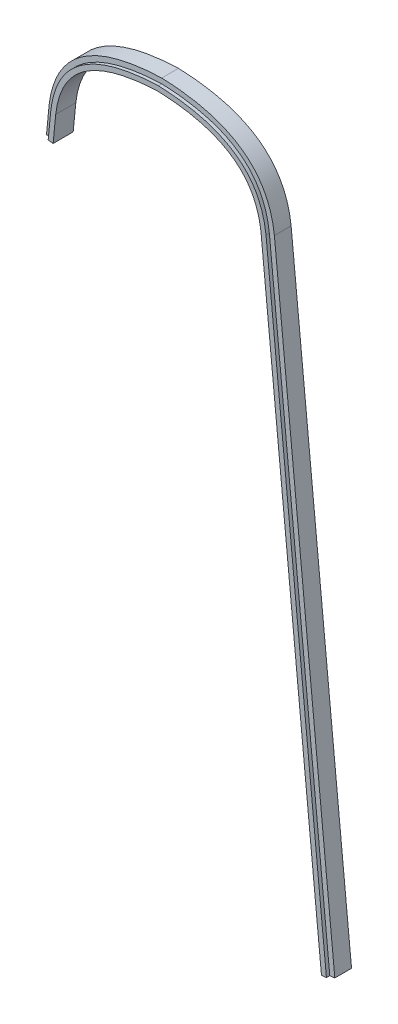
ISO-10303-21;
HEADER;
FILE_DESCRIPTION(('STEP AP214'),'2;1');
FILE_NAME('part.step','',(''),(''),'','','');
FILE_SCHEMA(('AUTOMOTIVE_DESIGN { 1 0 10303 214 1 1 1 1 }'));
ENDSEC;
DATA;
#1=APPLICATION_CONTEXT('core data for automotive mechanical design processes');
#2=APPLICATION_PROTOCOL_DEFINITION('international standard','automotive_design',2000,#1);
#3=PRODUCT_CONTEXT('',#1,'mechanical');
#4=PRODUCT('Part','Part','',(#3));
#5=PRODUCT_RELATED_PRODUCT_CATEGORY('part','',(#4));
#6=PRODUCT_DEFINITION_FORMATION('','',#4);
#7=PRODUCT_DEFINITION_CONTEXT('part definition',#1,'design');
#8=PRODUCT_DEFINITION('design','',#6,#7);
#9=PRODUCT_DEFINITION_SHAPE('','',#8);
#10=(LENGTH_UNIT() NAMED_UNIT(*) SI_UNIT(.MILLI.,.METRE.));
#11=(NAMED_UNIT(*) PLANE_ANGLE_UNIT() SI_UNIT($,.RADIAN.));
#12=(NAMED_UNIT(*) SI_UNIT($,.STERADIAN.) SOLID_ANGLE_UNIT());
#13=UNCERTAINTY_MEASURE_WITH_UNIT(LENGTH_MEASURE(1.E-05),#10,'distance_accuracy_value','');
#14=(GEOMETRIC_REPRESENTATION_CONTEXT(3) GLOBAL_UNCERTAINTY_ASSIGNED_CONTEXT((#13)) GLOBAL_UNIT_ASSIGNED_CONTEXT((#10,
#11,#12)) REPRESENTATION_CONTEXT('',''));
#15=CARTESIAN_POINT('',(0.,0.,0.));
#16=DIRECTION('',(0.,0.,1.));
#17=DIRECTION('',(1.,0.,0.));
#18=AXIS2_PLACEMENT_3D('',#15,#16,#17);
#19=CARTESIAN_POINT('',(106.876080835467,736.833680097404,19.05));
#20=CARTESIAN_POINT('',(98.6555645680486,809.385111394009,19.05));
#21=CARTESIAN_POINT('',(0.,812.8,19.05));
#22=B_SPLINE_CURVE_WITH_KNOTS('',2,(#19,#20,#21),.UNSPECIFIED.,.F.,.F.,(3,3),(0.,1.),.UNSPECIFIED.);
#23=DIRECTION('',(0.,0.,-1.));
#24=VECTOR('',#23,1.);
#25=SURFACE_OF_LINEAR_EXTRUSION('',#22,#24);
#26=DIRECTION('',(0.,0.,-1.));
#27=VECTOR('',#26,1.);
#28=CARTESIAN_POINT('',(0.,812.8,19.05));
#29=LINE('',#28,#27);
#30=CARTESIAN_POINT('',(0.,812.8,15.875));
#31=VERTEX_POINT('',#30);
#32=CARTESIAN_POINT('',(0.,812.8,0.));
#33=VERTEX_POINT('',#32);
#34=EDGE_CURVE('E11',#31,#33,#29,.T.);
#35=ORIENTED_EDGE('',*,*,#34,.F.);
#36=CARTESIAN_POINT('',(106.876080835467,736.833680097404,15.875));
#37=CARTESIAN_POINT('',(98.6555645680486,809.385111394009,15.875));
#38=CARTESIAN_POINT('',(0.,812.8,15.875));
#39=B_SPLINE_CURVE_WITH_KNOTS('',2,(#36,#37,#38),.UNSPECIFIED.,.F.,.F.,(3,3),(0.,1.),.UNSPECIFIED.);
#40=CARTESIAN_POINT('',(106.876080835467,736.833680097404,15.875));
#41=VERTEX_POINT('',#40);
#42=EDGE_CURVE('E385',#41,#31,#39,.T.);
#43=ORIENTED_EDGE('',*,*,#42,.F.);
#44=DIRECTION('',(0.,0.,-1.));
#45=VECTOR('',#44,1.);
#46=CARTESIAN_POINT('',(106.876080835467,736.833680097404,19.05));
#47=LINE('',#46,#45);
#48=CARTESIAN_POINT('',(106.876080835467,736.833680097404,0.));
#49=VERTEX_POINT('',#48);
#50=EDGE_CURVE('E96',#41,#49,#47,.T.);
#51=ORIENTED_EDGE('',*,*,#50,.T.);
#52=CARTESIAN_POINT('',(106.876080835467,736.833680097404,0.));
#53=CARTESIAN_POINT('',(98.6555645680486,809.385111394009,0.));
#54=CARTESIAN_POINT('',(0.,812.8,0.));
#55=B_SPLINE_CURVE_WITH_KNOTS('',2,(#52,#53,#54),.UNSPECIFIED.,.F.,.F.,(3,3),(0.,1.),.UNSPECIFIED.);
#56=EDGE_CURVE('E224',#49,#33,#55,.T.);
#57=ORIENTED_EDGE('',*,*,#56,.T.);
#58=EDGE_LOOP('',(#35,#43,#51,#57));
#59=FACE_BOUND('',#58,.T.);
#60=ADVANCED_FACE('F33',(#59),#25,.F.);
#61=CARTESIAN_POINT('',(0.,812.8,19.05));
#62=CARTESIAN_POINT('',(-98.6555645680486,809.385111394009,19.05));
#63=CARTESIAN_POINT('',(-106.876080835467,736.833680097404,19.05));
#64=B_SPLINE_CURVE_WITH_KNOTS('',2,(#61,#62,#63),.UNSPECIFIED.,.F.,.F.,(3,3),(0.,1.),.UNSPECIFIED.);
#65=DIRECTION('',(0.,0.,-1.));
#66=VECTOR('',#65,1.);
#67=SURFACE_OF_LINEAR_EXTRUSION('',#64,#66);
#68=DIRECTION('',(0.,0.,-1.));
#69=VECTOR('',#68,1.);
#70=CARTESIAN_POINT('',(-106.876080835467,736.833680097404,19.05));
#71=LINE('',#70,#69);
#72=CARTESIAN_POINT('',(-106.876080835467,736.833680097404,15.875));
#73=VERTEX_POINT('',#72);
#74=CARTESIAN_POINT('',(-106.876080835467,736.833680097404,0.));
#75=VERTEX_POINT('',#74);
#76=EDGE_CURVE('E41',#73,#75,#71,.T.);
#77=ORIENTED_EDGE('',*,*,#76,.F.);
#78=CARTESIAN_POINT('',(0.,812.8,15.875));
#79=CARTESIAN_POINT('',(-98.6555645680486,809.385111394009,15.875));
#80=CARTESIAN_POINT('',(-106.876080835467,736.833680097404,15.875));
#81=B_SPLINE_CURVE_WITH_KNOTS('',2,(#78,#79,#80),.UNSPECIFIED.,.F.,.F.,(3,3),(0.,1.),.UNSPECIFIED.);
#82=EDGE_CURVE('E386',#31,#73,#81,.T.);
#83=ORIENTED_EDGE('',*,*,#82,.F.);
#84=ORIENTED_EDGE('',*,*,#34,.T.);
#85=CARTESIAN_POINT('',(0.,812.8,0.));
#86=CARTESIAN_POINT('',(-98.6555645680486,809.385111394009,0.));
#87=CARTESIAN_POINT('',(-106.876080835467,736.833680097404,0.));
#88=B_SPLINE_CURVE_WITH_KNOTS('',2,(#85,#86,#87),.UNSPECIFIED.,.F.,.F.,(3,3),(0.,1.),.UNSPECIFIED.);
#89=EDGE_CURVE('E221',#33,#75,#88,.T.);
#90=ORIENTED_EDGE('',*,*,#89,.T.);
#91=EDGE_LOOP('',(#77,#83,#84,#90));
#92=FACE_BOUND('',#91,.T.);
#93=ADVANCED_FACE('F169',(#92),#67,.F.);
#94=CARTESIAN_POINT('',(-109.368223300656,711.556235093346,19.05));
#95=DIRECTION('',(0.995175000159784,-0.0981158450861764,0.));
#96=DIRECTION('',(0.0981158450861764,0.995175000159784,0.));
#97=AXIS2_PLACEMENT_3D('',#94,#95,#96);
#98=PLANE('',#97);
#99=DIRECTION('',(0.,0.,-1.));
#100=VECTOR('',#99,1.);
#101=CARTESIAN_POINT('',(-109.368223300656,711.556235093346,19.05));
#102=LINE('',#101,#100);
#103=CARTESIAN_POINT('',(-109.368223300656,711.556235093346,15.875));
#104=VERTEX_POINT('',#103);
#105=CARTESIAN_POINT('',(-109.368223300656,711.556235093346,0.));
#106=VERTEX_POINT('',#105);
#107=EDGE_CURVE('E207',#104,#106,#102,.T.);
#108=ORIENTED_EDGE('',*,*,#107,.F.);
#109=DIRECTION('',(-0.0981158450861764,-0.995175000159784,0.));
#110=VECTOR('',#109,1.);
#111=CARTESIAN_POINT('',(-109.368223300656,711.556235093346,15.875));
#112=LINE('',#111,#110);
#113=EDGE_CURVE('E218',#73,#104,#112,.T.);
#114=ORIENTED_EDGE('',*,*,#113,.F.);
#115=ORIENTED_EDGE('',*,*,#76,.T.);
#116=DIRECTION('',(-0.0981158450861764,-0.995175000159784,0.));
#117=VECTOR('',#116,1.);
#118=CARTESIAN_POINT('',(-109.368223300656,711.556235093346,0.));
#119=LINE('',#118,#117);
#120=EDGE_CURVE('E214',#75,#106,#119,.T.);
#121=ORIENTED_EDGE('',*,*,#120,.T.);
#122=EDGE_LOOP('',(#108,#114,#115,#121));
#123=FACE_BOUND('',#122,.T.);
#124=ADVANCED_FACE('F166',(#123),#98,.F.);
#125=CARTESIAN_POINT('',(-109.368223300656,711.556235093346,19.05));
#126=DIRECTION('',(0.0981158450861748,0.995175000159784,0.));
#127=DIRECTION('',(-0.995175000159784,0.0981158450861748,0.));
#128=AXIS2_PLACEMENT_3D('',#125,#126,#127);
#129=PLANE('',#128);
#130=DIRECTION('',(0.995175000159784,-0.0981158450861748,0.));
#131=VECTOR('',#130,1.);
#132=CARTESIAN_POINT('',(-109.368223300656,711.556235093346,19.05));
#133=LINE('',#132,#131);
#134=CARTESIAN_POINT('',(-104.590786194889,711.085220167425,19.05));
#135=VERTEX_POINT('',#134);
#136=CARTESIAN_POINT('',(-99.8891814241341,710.6216816689,19.05));
#137=VERTEX_POINT('',#136);
#138=EDGE_CURVE('E104',#135,#137,#133,.T.);
#139=ORIENTED_EDGE('',*,*,#138,.F.);
#140=DIRECTION('',(0.,0.,-1.));
#141=VECTOR('',#140,1.);
#142=CARTESIAN_POINT('',(-104.590786194889,711.085220167425,934.258236266733));
#143=LINE('',#142,#141);
#144=CARTESIAN_POINT('',(-104.590786194889,711.085220167425,15.875));
#145=VERTEX_POINT('',#144);
#146=EDGE_CURVE('E260',#135,#145,#143,.T.);
#147=ORIENTED_EDGE('',*,*,#146,.T.);
#148=DIRECTION('',(0.995175000159784,-0.0981158450861748,0.));
#149=VECTOR('',#148,1.);
#150=CARTESIAN_POINT('',(-109.368223300656,711.556235093346,15.875));
#151=LINE('',#150,#149);
#152=EDGE_CURVE('E388',#104,#145,#151,.T.);
#153=ORIENTED_EDGE('',*,*,#152,.F.);
#154=ORIENTED_EDGE('',*,*,#107,.T.);
#155=DIRECTION('',(0.995175000159784,-0.0981158450861748,0.));
#156=VECTOR('',#155,1.);
#157=CARTESIAN_POINT('',(-109.368223300656,711.556235093346,0.));
#158=LINE('',#157,#156);
#159=CARTESIAN_POINT('',(-99.8891814241341,710.6216816689,0.));
#160=VERTEX_POINT('',#159);
#161=EDGE_CURVE('E228',#106,#160,#158,.T.);
#162=ORIENTED_EDGE('',*,*,#161,.T.);
#163=DIRECTION('',(0.,0.,-1.));
#164=VECTOR('',#163,1.);
#165=CARTESIAN_POINT('',(-99.8891814241341,710.6216816689,19.05));
#166=LINE('',#165,#164);
#167=EDGE_CURVE('E204',#137,#160,#166,.T.);
#168=ORIENTED_EDGE('',*,*,#167,.F.);
#169=EDGE_LOOP('',(#139,#147,#153,#154,#162,#168));
#170=FACE_BOUND('',#169,.T.);
#171=ADVANCED_FACE('F162',(#170),#129,.F.);
#172=CARTESIAN_POINT('',(-99.8891814241341,710.6216816689,19.05));
#173=DIRECTION('',(-0.995175000159784,0.0981158450861764,0.));
#174=DIRECTION('',(-0.0981158450861764,-0.995175000159784,0.));
#175=AXIS2_PLACEMENT_3D('',#172,#173,#174);
#176=PLANE('',#175);
#177=DIRECTION('',(0.0981158450861764,0.995175000159784,0.));
#178=VECTOR('',#177,1.);
#179=CARTESIAN_POINT('',(-99.8891814241341,710.6216816689,0.));
#180=LINE('',#179,#178);
#181=CARTESIAN_POINT('',(-97.4039935722559,735.828587023664,0.));
#182=VERTEX_POINT('',#181);
#183=EDGE_CURVE('E230',#160,#182,#180,.T.);
#184=ORIENTED_EDGE('',*,*,#183,.T.);
#185=DIRECTION('',(0.,0.,-1.));
#186=VECTOR('',#185,1.);
#187=CARTESIAN_POINT('',(-97.4039935722559,735.828587023664,19.05));
#188=LINE('',#187,#186);
#189=CARTESIAN_POINT('',(-97.4039935722559,735.828587023664,19.05));
#190=VERTEX_POINT('',#189);
#191=EDGE_CURVE('E132',#190,#182,#188,.T.);
#192=ORIENTED_EDGE('',*,*,#191,.F.);
#193=DIRECTION('',(0.0981158450861764,0.995175000159784,0.));
#194=VECTOR('',#193,1.);
#195=CARTESIAN_POINT('',(-99.8891814241341,710.6216816689,19.05));
#196=LINE('',#195,#194);
#197=EDGE_CURVE('E120',#137,#190,#196,.T.);
#198=ORIENTED_EDGE('',*,*,#197,.F.);
#199=ORIENTED_EDGE('',*,*,#167,.T.);
#200=EDGE_LOOP('',(#184,#192,#198,#199));
#201=FACE_BOUND('',#200,.T.);
#202=ADVANCED_FACE('F159',(#201),#176,.F.);
#203=CARTESIAN_POINT('',(-97.4039935722559,735.828587023664,19.05));
#204=CARTESIAN_POINT('',(-97.3262059512527,736.510966359992,19.05));
#205=CARTESIAN_POINT('',(-97.1553796672026,737.881968464566,19.05));
#206=CARTESIAN_POINT('',(-96.7640206157546,740.553537606217,19.05));
#207=CARTESIAN_POINT('',(-96.1773627381838,743.805316844235,19.05));
#208=CARTESIAN_POINT('',(-95.3214140006328,747.554999290887,19.05));
#209=CARTESIAN_POINT('',(-93.9799340011733,752.359286406523,19.05));
#210=CARTESIAN_POINT('',(-91.9331304846631,758.003164249533,19.05));
#211=CARTESIAN_POINT('',(-88.8952522600479,764.228265264046,19.05));
#212=CARTESIAN_POINT('',(-85.2743135617021,769.943199813082,19.05));
#213=CARTESIAN_POINT('',(-79.6482414168434,776.932392043286,19.05));
#214=CARTESIAN_POINT('',(-71.0507907120011,784.572420077556,19.05));
#215=CARTESIAN_POINT('',(-60.1294569627941,790.832450745801,19.05));
#216=CARTESIAN_POINT('',(-49.8978420395012,794.967332344283,19.05));
#217=CARTESIAN_POINT('',(-41.4669949701447,797.61410959326,19.05));
#218=CARTESIAN_POINT('',(-32.2731280075781,799.79005238411,19.05));
#219=CARTESIAN_POINT('',(-23.975792062962,801.1984248908,19.05));
#220=CARTESIAN_POINT('',(-16.9573043317647,802.075979485788,19.05));
#221=CARTESIAN_POINT('',(-11.5049121120335,802.608232021652,19.05));
#222=CARTESIAN_POINT('',(-6.80036284859527,802.946009067599,19.05));
#223=CARTESIAN_POINT('',(-2.95007512349235,803.15190905775,19.05));
#224=CARTESIAN_POINT('',(-0.979817657945946,803.233925105122,19.05));
#225=CARTESIAN_POINT('',(4.83771009363032E-13,803.269086279872,19.05));
#226=B_SPLINE_CURVE_WITH_KNOTS('',3,(#203,#204,#205,#206,#207,#208,#209,#210,#211,#212,#213,
#214,#215,#216,#217,#218,#219,#220,#221,#222,#223,#224,#225),.UNSPECIFIED.,.F.,.F.,(4,1,1,1,1,1,
1,1,1,1,1,1,1,1,1,1,1,1,1,1,4),(0.00050817300302827,0.0160981610016207,0.0316881490002131,
0.0628681249973979,0.0940481009945827,0.125228076991767,0.187588028986137,0.249947980980507,
0.312307932974876,0.374667884969246,0.499387788957985,0.624107692946725,0.686467644941094,
0.748827596935464,0.811187548929833,0.873547500924203,0.904727476921388,0.935907452918573,
0.967087428915757,0.98267741691435,0.998267404912942),.UNSPECIFIED.);
#227=DIRECTION('',(0.,0.,-1.));
#228=VECTOR('',#227,1.);
#229=SURFACE_OF_LINEAR_EXTRUSION('',#226,#228);
#230=CARTESIAN_POINT('',(-97.4039935722559,735.828587023664,0.));
#231=CARTESIAN_POINT('',(-97.3262059512527,736.510966359992,0.));
#232=CARTESIAN_POINT('',(-97.1553796672026,737.881968464566,0.));
#233=CARTESIAN_POINT('',(-96.7640206157546,740.553537606217,0.));
#234=CARTESIAN_POINT('',(-96.1773627381838,743.805316844235,0.));
#235=CARTESIAN_POINT('',(-95.3214140006328,747.554999290887,0.));
#236=CARTESIAN_POINT('',(-93.9799340011733,752.359286406523,0.));
#237=CARTESIAN_POINT('',(-91.9331304846631,758.003164249533,0.));
#238=CARTESIAN_POINT('',(-88.8952522600479,764.228265264046,0.));
#239=CARTESIAN_POINT('',(-85.2743135617021,769.943199813082,0.));
#240=CARTESIAN_POINT('',(-79.6482414168434,776.932392043286,0.));
#241=CARTESIAN_POINT('',(-71.0507907120011,784.572420077556,0.));
#242=CARTESIAN_POINT('',(-60.1294569627941,790.832450745801,0.));
#243=CARTESIAN_POINT('',(-49.8978420395012,794.967332344283,0.));
#244=CARTESIAN_POINT('',(-41.4669949701447,797.61410959326,0.));
#245=CARTESIAN_POINT('',(-32.2731280075781,799.79005238411,0.));
#246=CARTESIAN_POINT('',(-23.975792062962,801.1984248908,0.));
#247=CARTESIAN_POINT('',(-16.9573043317647,802.075979485788,0.));
#248=CARTESIAN_POINT('',(-11.5049121120335,802.608232021652,0.));
#249=CARTESIAN_POINT('',(-6.80036284859527,802.946009067599,0.));
#250=CARTESIAN_POINT('',(-2.95007512349235,803.15190905775,0.));
#251=CARTESIAN_POINT('',(-0.979817657945946,803.233925105122,0.));
#252=CARTESIAN_POINT('',(4.83771009363032E-13,803.269086279872,0.));
#253=B_SPLINE_CURVE_WITH_KNOTS('',3,(#230,#231,#232,#233,#234,#235,#236,#237,#238,#239,#240,
#241,#242,#243,#244,#245,#246,#247,#248,#249,#250,#251,#252),.UNSPECIFIED.,.F.,.F.,(4,1,1,1,1,1,
1,1,1,1,1,1,1,1,1,1,1,1,1,1,4),(0.00050817300302827,0.0160981610016207,0.0316881490002131,
0.0628681249973979,0.0940481009945827,0.125228076991767,0.187588028986137,0.249947980980507,
0.312307932974876,0.374667884969246,0.499387788957985,0.624107692946725,0.686467644941094,
0.748827596935464,0.811187548929833,0.873547500924203,0.904727476921388,0.935907452918573,
0.967087428915757,0.98267741691435,0.998267404912942),.UNSPECIFIED.);
#254=CARTESIAN_POINT('',(4.83771009363032E-13,803.269086279872,0.));
#255=VERTEX_POINT('',#254);
#256=EDGE_CURVE('E129',#182,#255,#253,.T.);
#257=ORIENTED_EDGE('',*,*,#256,.T.);
#258=DIRECTION('',(0.,0.,-1.));
#259=VECTOR('',#258,1.);
#260=CARTESIAN_POINT('',(4.83771009363032E-13,803.269086279872,19.05));
#261=LINE('',#260,#259);
#262=CARTESIAN_POINT('',(4.83771009363032E-13,803.269086279872,19.05));
#263=VERTEX_POINT('',#262);
#264=EDGE_CURVE('E126',#263,#255,#261,.T.);
#265=ORIENTED_EDGE('',*,*,#264,.F.);
#266=EDGE_CURVE('E112',#190,#263,#226,.T.);
#267=ORIENTED_EDGE('',*,*,#266,.F.);
#268=ORIENTED_EDGE('',*,*,#191,.T.);
#269=EDGE_LOOP('',(#257,#265,#267,#268));
#270=FACE_BOUND('',#269,.T.);
#271=ADVANCED_FACE('F127',(#270),#229,.F.);
#272=CARTESIAN_POINT('',(-4.7309161796405E-13,803.269086279872,19.05));
#273=CARTESIAN_POINT('',(0.979817657946005,803.233925105122,19.05));
#274=CARTESIAN_POINT('',(2.95007512349249,803.15190905775,19.05));
#275=CARTESIAN_POINT('',(6.80036284859567,802.946009067599,19.05));
#276=CARTESIAN_POINT('',(11.5049121120341,802.608232021652,19.05));
#277=CARTESIAN_POINT('',(16.9573043317656,802.075979485788,19.05));
#278=CARTESIAN_POINT('',(23.9757920629632,801.198424890801,19.05));
#279=CARTESIAN_POINT('',(32.2731280075797,799.79005238411,19.05));
#280=CARTESIAN_POINT('',(41.4669949701467,797.61410959326,19.05));
#281=CARTESIAN_POINT('',(49.8978420395034,794.967332344282,19.05));
#282=CARTESIAN_POINT('',(60.1294569627966,790.8324507458,19.05));
#283=CARTESIAN_POINT('',(71.0507907120036,784.572420077554,19.05));
#284=CARTESIAN_POINT('',(79.648241416846,776.932392043284,19.05));
#285=CARTESIAN_POINT('',(85.2743135617045,769.943199813078,19.05));
#286=CARTESIAN_POINT('',(88.8952522600501,764.228265264043,19.05));
#287=CARTESIAN_POINT('',(91.9331304846649,758.003164249528,19.05));
#288=CARTESIAN_POINT('',(93.979934001175,752.359286406518,19.05));
#289=CARTESIAN_POINT('',(95.3214140006343,747.554999290881,19.05));
#290=CARTESIAN_POINT('',(96.1773627381851,743.805316844229,19.05));
#291=CARTESIAN_POINT('',(96.7640206157557,740.553537606211,19.05));
#292=CARTESIAN_POINT('',(97.1553796672036,737.88196846456,19.05));
#293=CARTESIAN_POINT('',(97.3262059512535,736.510966359985,19.05));
#294=CARTESIAN_POINT('',(97.4039935722567,735.828587023657,19.05));
#295=B_SPLINE_CURVE_WITH_KNOTS('',3,(#272,#273,#274,#275,#276,#277,#278,#279,#280,#281,#282,
#283,#284,#285,#286,#287,#288,#289,#290,#291,#292,#293,#294),.UNSPECIFIED.,.F.,.F.,(4,1,1,1,1,1,
1,1,1,1,1,1,1,1,1,1,1,1,1,1,4),(0.000508173002974233,0.0160981610015676,0.0316881490001608,
0.0628681249973473,0.0940481009945338,0.12522807699172,0.187588028986093,0.249947980980466,
0.312307932974839,0.374667884969212,0.499387788957958,0.624107692946704,0.686467644941077,
0.74882759693545,0.811187548929823,0.873547500924196,0.904727476921383,0.935907452918569,
0.967087428915756,0.982677416914349,0.998267404912942),.UNSPECIFIED.);
#296=DIRECTION('',(0.,0.,-1.));
#297=VECTOR('',#296,1.);
#298=SURFACE_OF_LINEAR_EXTRUSION('',#295,#297);
#299=CARTESIAN_POINT('',(-4.7309161796405E-13,803.269086279872,0.));
#300=CARTESIAN_POINT('',(0.979817657946005,803.233925105122,0.));
#301=CARTESIAN_POINT('',(2.95007512349249,803.15190905775,0.));
#302=CARTESIAN_POINT('',(6.80036284859567,802.946009067599,0.));
#303=CARTESIAN_POINT('',(11.5049121120341,802.608232021652,0.));
#304=CARTESIAN_POINT('',(16.9573043317656,802.075979485788,0.));
#305=CARTESIAN_POINT('',(23.9757920629632,801.198424890801,0.));
#306=CARTESIAN_POINT('',(32.2731280075797,799.79005238411,0.));
#307=CARTESIAN_POINT('',(41.4669949701467,797.61410959326,0.));
#308=CARTESIAN_POINT('',(49.8978420395034,794.967332344282,0.));
#309=CARTESIAN_POINT('',(60.1294569627966,790.8324507458,0.));
#310=CARTESIAN_POINT('',(71.0507907120036,784.572420077554,0.));
#311=CARTESIAN_POINT('',(79.648241416846,776.932392043284,0.));
#312=CARTESIAN_POINT('',(85.2743135617045,769.943199813078,0.));
#313=CARTESIAN_POINT('',(88.8952522600501,764.228265264043,0.));
#314=CARTESIAN_POINT('',(91.9331304846649,758.003164249528,0.));
#315=CARTESIAN_POINT('',(93.979934001175,752.359286406518,0.));
#316=CARTESIAN_POINT('',(95.3214140006343,747.554999290881,0.));
#317=CARTESIAN_POINT('',(96.1773627381851,743.805316844229,0.));
#318=CARTESIAN_POINT('',(96.7640206157557,740.553537606211,0.));
#319=CARTESIAN_POINT('',(97.1553796672036,737.88196846456,0.));
#320=CARTESIAN_POINT('',(97.3262059512535,736.510966359985,0.));
#321=CARTESIAN_POINT('',(97.4039935722567,735.828587023657,0.));
#322=B_SPLINE_CURVE_WITH_KNOTS('',3,(#299,#300,#301,#302,#303,#304,#305,#306,#307,#308,#309,
#310,#311,#312,#313,#314,#315,#316,#317,#318,#319,#320,#321),.UNSPECIFIED.,.F.,.F.,(4,1,1,1,1,1,
1,1,1,1,1,1,1,1,1,1,1,1,1,1,4),(0.000508173002974233,0.0160981610015676,0.0316881490001608,
0.0628681249973473,0.0940481009945338,0.12522807699172,0.187588028986093,0.249947980980466,
0.312307932974839,0.374667884969212,0.499387788957958,0.624107692946704,0.686467644941077,
0.74882759693545,0.811187548929823,0.873547500924196,0.904727476921383,0.935907452918569,
0.967087428915756,0.982677416914349,0.998267404912942),.UNSPECIFIED.);
#323=CARTESIAN_POINT('',(97.4039935722567,735.828587023657,0.));
#324=VERTEX_POINT('',#323);
#325=EDGE_CURVE('E240',#255,#324,#322,.T.);
#326=ORIENTED_EDGE('',*,*,#325,.T.);
#327=DIRECTION('',(0.,0.,-1.));
#328=VECTOR('',#327,1.);
#329=CARTESIAN_POINT('',(97.4039935722567,735.828587023657,19.05));
#330=LINE('',#329,#328);
#331=CARTESIAN_POINT('',(97.4039935722567,735.828587023657,19.05));
#332=VERTEX_POINT('',#331);
#333=EDGE_CURVE('E133',#332,#324,#330,.T.);
#334=ORIENTED_EDGE('',*,*,#333,.F.);
#335=EDGE_CURVE('E117',#263,#332,#295,.T.);
#336=ORIENTED_EDGE('',*,*,#335,.F.);
#337=ORIENTED_EDGE('',*,*,#264,.T.);
#338=EDGE_LOOP('',(#326,#334,#336,#337));
#339=FACE_BOUND('',#338,.T.);
#340=ADVANCED_FACE('F135',(#339),#298,.F.);
#341=CARTESIAN_POINT('',(154.716315658705,154.517891579654,19.05));
#342=DIRECTION('',(0.995175000159714,0.0981158450868872,0.));
#343=DIRECTION('',(-0.0981158450868872,0.995175000159714,0.));
#344=AXIS2_PLACEMENT_3D('',#341,#342,#343);
#345=PLANE('',#344);
#346=DIRECTION('',(0.0981158450868872,-0.995175000159714,0.));
#347=VECTOR('',#346,1.);
#348=CARTESIAN_POINT('',(154.716315658705,154.517891579654,0.));
#349=LINE('',#348,#347);
#350=CARTESIAN_POINT('',(154.716315658705,154.517891579654,0.));
#351=VERTEX_POINT('',#350);
#352=EDGE_CURVE('E192',#324,#351,#349,.T.);
#353=ORIENTED_EDGE('',*,*,#352,.T.);
#354=DIRECTION('',(0.,0.,-1.));
#355=VECTOR('',#354,1.);
#356=CARTESIAN_POINT('',(154.716315658705,154.517891579654,19.05));
#357=LINE('',#356,#355);
#358=CARTESIAN_POINT('',(154.716315658705,154.517891579654,19.05));
#359=VERTEX_POINT('',#358);
#360=EDGE_CURVE('E199',#359,#351,#357,.T.);
#361=ORIENTED_EDGE('',*,*,#360,.F.);
#362=DIRECTION('',(0.0981158450868872,-0.995175000159714,0.));
#363=VECTOR('',#362,1.);
#364=CARTESIAN_POINT('',(154.716315658705,154.517891579654,19.05));
#365=LINE('',#364,#363);
#366=EDGE_CURVE('E57',#332,#359,#365,.T.);
#367=ORIENTED_EDGE('',*,*,#366,.F.);
#368=ORIENTED_EDGE('',*,*,#333,.T.);
#369=EDGE_LOOP('',(#353,#361,#367,#368));
#370=FACE_BOUND('',#369,.T.);
#371=ADVANCED_FACE('F155',(#370),#345,.F.);
#372=CARTESIAN_POINT('',(154.716315658705,154.517891579654,19.05));
#373=DIRECTION('',(-0.0981158450868834,0.995175000159714,0.));
#374=DIRECTION('',(-0.995175000159714,-0.0981158450868834,0.));
#375=AXIS2_PLACEMENT_3D('',#372,#373,#374);
#376=PLANE('',#375);
#377=DIRECTION('',(0.995175000159714,0.0981158450868834,0.));
#378=VECTOR('',#377,1.);
#379=CARTESIAN_POINT('',(154.716315658705,154.517891579654,15.875));
#380=LINE('',#379,#378);
#381=CARTESIAN_POINT('',(159.417920429459,154.981430078182,15.875));
#382=VERTEX_POINT('',#381);
#383=CARTESIAN_POINT('',(164.195357535226,155.452445004106,15.875));
#384=VERTEX_POINT('',#383);
#385=EDGE_CURVE('E306',#382,#384,#380,.T.);
#386=ORIENTED_EDGE('',*,*,#385,.F.);
#387=DIRECTION('',(0.,0.,-1.));
#388=VECTOR('',#387,1.);
#389=CARTESIAN_POINT('',(159.417920429459,154.981430078182,934.258236266733));
#390=LINE('',#389,#388);
#391=CARTESIAN_POINT('',(159.417920429459,154.981430078182,19.05));
#392=VERTEX_POINT('',#391);
#393=EDGE_CURVE('E341',#392,#382,#390,.T.);
#394=ORIENTED_EDGE('',*,*,#393,.F.);
#395=DIRECTION('',(0.995175000159714,0.0981158450868834,0.));
#396=VECTOR('',#395,1.);
#397=CARTESIAN_POINT('',(154.716315658705,154.517891579654,19.05));
#398=LINE('',#397,#396);
#399=EDGE_CURVE('E138',#359,#392,#398,.T.);
#400=ORIENTED_EDGE('',*,*,#399,.F.);
#401=ORIENTED_EDGE('',*,*,#360,.T.);
#402=DIRECTION('',(0.995175000159714,0.0981158450868834,0.));
#403=VECTOR('',#402,1.);
#404=CARTESIAN_POINT('',(154.716315658705,154.517891579654,0.));
#405=LINE('',#404,#403);
#406=CARTESIAN_POINT('',(164.195357535226,155.452445004106,0.));
#407=VERTEX_POINT('',#406);
#408=EDGE_CURVE('E186',#351,#407,#405,.T.);
#409=ORIENTED_EDGE('',*,*,#408,.T.);
#410=DIRECTION('',(0.,0.,-1.));
#411=VECTOR('',#410,1.);
#412=CARTESIAN_POINT('',(164.195357535226,155.452445004106,19.05));
#413=LINE('',#412,#411);
#414=EDGE_CURVE('E197',#384,#407,#413,.T.);
#415=ORIENTED_EDGE('',*,*,#414,.F.);
#416=EDGE_LOOP('',(#386,#394,#400,#401,#409,#415));
#417=FACE_BOUND('',#416,.T.);
#418=ADVANCED_FACE('F255',(#417),#376,.F.);
#419=CARTESIAN_POINT('',(164.195357535226,155.452445004106,19.05));
#420=DIRECTION('',(-0.995175000159714,-0.0981158450868872,0.));
#421=DIRECTION('',(0.0981158450868872,-0.995175000159714,0.));
#422=AXIS2_PLACEMENT_3D('',#419,#420,#421);
#423=PLANE('',#422);
#424=ORIENTED_EDGE('',*,*,#50,.F.);
#425=DIRECTION('',(-0.0981158450868872,0.995175000159713,0.));
#426=VECTOR('',#425,1.);
#427=CARTESIAN_POINT('',(164.195357535226,155.452445004106,15.875));
#428=LINE('',#427,#426);
#429=EDGE_CURVE('E308',#384,#41,#428,.T.);
#430=ORIENTED_EDGE('',*,*,#429,.F.);
#431=ORIENTED_EDGE('',*,*,#414,.T.);
#432=DIRECTION('',(-0.0981158450868872,0.995175000159713,0.));
#433=VECTOR('',#432,1.);
#434=CARTESIAN_POINT('',(164.195357535226,155.452445004106,0.));
#435=LINE('',#434,#433);
#436=EDGE_CURVE('E185',#407,#49,#435,.T.);
#437=ORIENTED_EDGE('',*,*,#436,.T.);
#438=EDGE_LOOP('',(#424,#430,#431,#437));
#439=FACE_BOUND('',#438,.T.);
#440=ADVANCED_FACE('F373',(#439),#423,.F.);
#441=CARTESIAN_POINT('',(76.0468024928911,792.100975721355,19.05));
#442=DIRECTION('',(0.,0.,-1.));
#443=DIRECTION('',(-1.,0.,0.));
#444=AXIS2_PLACEMENT_3D('',#441,#442,#443);
#445=PLANE('',#444);
#446=CARTESIAN_POINT('',(1.38690835617232E-09,807.996472787255,19.05));
#447=CARTESIAN_POINT('',(-8.05944445898882,807.712436153082,19.05));
#448=CARTESIAN_POINT('',(-15.6327974963172,807.076135513586,19.05));
#449=CARTESIAN_POINT('',(-29.8010128304102,805.110989442442,19.05));
#450=CARTESIAN_POINT('',(-36.3956638363915,803.782123864795,19.05));
#451=CARTESIAN_POINT('',(-48.6044481154153,800.45028743027,19.05));
#452=CARTESIAN_POINT('',(-54.2182351196847,798.447532439277,19.05));
#453=CARTESIAN_POINT('',(-64.4762476808205,793.790894019696,19.05));
#454=CARTESIAN_POINT('',(-69.1203377814474,791.13766527237,19.05));
#455=CARTESIAN_POINT('',(-77.4720248220144,785.195018142692,19.05));
#456=CARTESIAN_POINT('',(-81.1803695924037,781.906189413553,19.05));
#457=CARTESIAN_POINT('',(-87.7088234454555,774.677407428115,19.05));
#458=CARTESIAN_POINT('',(-90.5300514390415,770.736815263352,19.05));
#459=CARTESIAN_POINT('',(-95.3156406059822,762.156711157177,19.05));
#460=CARTESIAN_POINT('',(-97.2799267155289,757.515989740069,19.05));
#461=CARTESIAN_POINT('',(-100.345590505541,747.487649133906,19.05));
#462=CARTESIAN_POINT('',(-101.4461430147,742.099771544388,19.05));
#463=CARTESIAN_POINT('',(-102.102109164147,736.327515765121,19.05));
#464=B_SPLINE_CURVE_WITH_KNOTS('',3,(#446,#447,#448,#449,#450,#451,#452,#453,#454,#455,#456,
#457,#458,#459,#460,#461,#462,#463),.UNSPECIFIED.,.F.,.F.,(4,2,2,2,2,2,2,2,4),(0.,0.125,0.25,
0.375,0.5,0.625,0.75,0.875,1.),.UNSPECIFIED.);
#465=CARTESIAN_POINT('',(-102.102109164147,736.327515765121,19.05));
#466=VERTEX_POINT('',#465);
#467=CARTESIAN_POINT('',(1.38660387762631E-09,807.99647278729,19.05));
#468=VERTEX_POINT('',#467);
#469=EDGE_CURVE('E315',#466,#468,#464,.F.);
#470=ORIENTED_EDGE('',*,*,#469,.F.);
#471=DIRECTION('',(0.0981158450859207,0.995175000159809,0.));
#472=VECTOR('',#471,1.);
#473=CARTESIAN_POINT('',(-102.102109164138,736.32751576511,19.05));
#474=LINE('',#473,#472);
#475=EDGE_CURVE('E321',#135,#466,#474,.T.);
#476=ORIENTED_EDGE('',*,*,#475,.F.);
#477=ORIENTED_EDGE('',*,*,#138,.T.);
#478=ORIENTED_EDGE('',*,*,#197,.T.);
#479=ORIENTED_EDGE('',*,*,#266,.T.);
#480=ORIENTED_EDGE('',*,*,#335,.T.);
#481=ORIENTED_EDGE('',*,*,#366,.T.);
#482=ORIENTED_EDGE('',*,*,#399,.T.);
#483=DIRECTION('',(0.0981158450868323,-0.995175000159719,0.));
#484=VECTOR('',#483,1.);
#485=CARTESIAN_POINT('',(159.417920429459,154.981430078182,19.05));
#486=LINE('',#485,#484);
#487=CARTESIAN_POINT('',(102.102109164698,736.327515759691,19.05));
#488=VERTEX_POINT('',#487);
#489=EDGE_CURVE('E270',#488,#392,#486,.T.);
#490=ORIENTED_EDGE('',*,*,#489,.F.);
#491=CARTESIAN_POINT('',(102.102109164675,736.327515759679,19.05));
#492=CARTESIAN_POINT('',(101.446143015497,742.099771539337,19.05));
#493=CARTESIAN_POINT('',(100.345590506587,747.487649129213,19.05));
#494=CARTESIAN_POINT('',(97.2799267170085,757.515989736072,19.05));
#495=CARTESIAN_POINT('',(95.3156406076609,762.156711153488,19.05));
#496=CARTESIAN_POINT('',(90.5300514410634,770.736815260259,19.05));
#497=CARTESIAN_POINT('',(87.7088234476366,774.677407425336,19.05));
#498=CARTESIAN_POINT('',(81.1803695948542,781.906189411279,19.05));
#499=CARTESIAN_POINT('',(77.4720248245617,785.195018140633,19.05));
#500=CARTESIAN_POINT('',(69.1203377841929,791.137665270742,19.05));
#501=CARTESIAN_POINT('',(64.4762476836538,793.79089401828,19.05));
#502=CARTESIAN_POINT('',(54.2182351226333,798.447532438233,19.05));
#503=CARTESIAN_POINT('',(48.6044481183779,800.450287429381,19.05));
#504=CARTESIAN_POINT('',(36.3956638393746,803.782123864219,19.05));
#505=CARTESIAN_POINT('',(29.8010128334138,805.110989442019,19.05));
#506=CARTESIAN_POINT('',(15.6327974992413,807.076135513412,19.05));
#507=CARTESIAN_POINT('',(8.05944446185263,807.712436153027,19.05));
#508=CARTESIAN_POINT('',(1.38660387762631E-09,807.99647278729,19.05));
#509=B_SPLINE_CURVE_WITH_KNOTS('',3,(#491,#492,#493,#494,#495,#496,#497,#498,#499,#500,#501,
#502,#503,#504,#505,#506,#507,#508),.UNSPECIFIED.,.F.,.F.,(4,2,2,2,2,2,2,2,4),(0.,0.125,0.25,
0.375,0.5,0.625,0.75,0.875,1.),.UNSPECIFIED.);
#510=EDGE_CURVE('E48',#468,#488,#509,.F.);
#511=ORIENTED_EDGE('',*,*,#510,.F.);
#512=EDGE_LOOP('',(#470,#476,#477,#478,#479,#480,#481,#482,#490,#511));
#513=FACE_BOUND('',#512,.T.);
#514=ADVANCED_FACE('F115',(#513),#445,.F.);
#515=CARTESIAN_POINT('',(76.0468024928911,792.100975721355,0.));
#516=DIRECTION('',(0.,0.,-1.));
#517=DIRECTION('',(-1.,0.,0.));
#518=AXIS2_PLACEMENT_3D('',#515,#516,#517);
#519=PLANE('',#518);
#520=ORIENTED_EDGE('',*,*,#56,.F.);
#521=ORIENTED_EDGE('',*,*,#436,.F.);
#522=ORIENTED_EDGE('',*,*,#408,.F.);
#523=ORIENTED_EDGE('',*,*,#352,.F.);
#524=ORIENTED_EDGE('',*,*,#325,.F.);
#525=ORIENTED_EDGE('',*,*,#256,.F.);
#526=ORIENTED_EDGE('',*,*,#183,.F.);
#527=ORIENTED_EDGE('',*,*,#161,.F.);
#528=ORIENTED_EDGE('',*,*,#120,.F.);
#529=ORIENTED_EDGE('',*,*,#89,.F.);
#530=EDGE_LOOP('',(#520,#521,#522,#523,#524,#525,#526,#527,#528,#529));
#531=FACE_BOUND('',#530,.T.);
#532=ADVANCED_FACE('F226',(#531),#519,.T.);
#533=CARTESIAN_POINT('',(-102.102109164138,736.32751576511,934.258236266733));
#534=DIRECTION('',(0.995175000159809,-0.0981158450859206,0.));
#535=DIRECTION('',(0.0981158450859207,0.995175000159809,0.));
#536=AXIS2_PLACEMENT_3D('',#533,#534,#535);
#537=PLANE('',#536);
#538=ORIENTED_EDGE('',*,*,#475,.T.);
#539=DIRECTION('',(0.,0.,-1.));
#540=VECTOR('',#539,1.);
#541=CARTESIAN_POINT('',(-102.102109164147,736.327515765121,934.258236266733));
#542=LINE('',#541,#540);
#543=CARTESIAN_POINT('',(-102.102109164142,736.327515765121,15.8750000000001));
#544=VERTEX_POINT('',#543);
#545=EDGE_CURVE('E258',#466,#544,#542,.T.);
#546=ORIENTED_EDGE('',*,*,#545,.T.);
#547=DIRECTION('',(0.0981158450859207,0.995175000159809,0.));
#548=VECTOR('',#547,1.);
#549=CARTESIAN_POINT('',(-102.102109164138,736.32751576511,15.875));
#550=LINE('',#549,#548);
#551=EDGE_CURVE('E344',#145,#544,#550,.T.);
#552=ORIENTED_EDGE('',*,*,#551,.F.);
#553=ORIENTED_EDGE('',*,*,#146,.F.);
#554=EDGE_LOOP('',(#538,#546,#552,#553));
#555=FACE_BOUND('',#554,.T.);
#556=ADVANCED_FACE('F322',(#555),#537,.F.);
#557=CARTESIAN_POINT('',(1.38690835617232E-09,807.996472787255,934.258236266733));
#558=CARTESIAN_POINT('',(-8.05944445898882,807.712436153082,934.258236266733));
#559=CARTESIAN_POINT('',(-15.6327974963172,807.076135513586,934.258236266733));
#560=CARTESIAN_POINT('',(-29.8010128304102,805.110989442442,934.258236266733));
#561=CARTESIAN_POINT('',(-36.3956638363915,803.782123864795,934.258236266733));
#562=CARTESIAN_POINT('',(-48.6044481154153,800.45028743027,934.258236266733));
#563=CARTESIAN_POINT('',(-54.2182351196847,798.447532439277,934.258236266733));
#564=CARTESIAN_POINT('',(-64.4762476808205,793.790894019696,934.258236266733));
#565=CARTESIAN_POINT('',(-69.1203377814474,791.13766527237,934.258236266733));
#566=CARTESIAN_POINT('',(-77.4720248220144,785.195018142692,934.258236266733));
#567=CARTESIAN_POINT('',(-81.1803695924037,781.906189413553,934.258236266733));
#568=CARTESIAN_POINT('',(-87.7088234454555,774.677407428115,934.258236266733));
#569=CARTESIAN_POINT('',(-90.5300514390415,770.736815263352,934.258236266733));
#570=CARTESIAN_POINT('',(-95.3156406059822,762.156711157177,934.258236266733));
#571=CARTESIAN_POINT('',(-97.2799267155289,757.515989740069,934.258236266733));
#572=CARTESIAN_POINT('',(-100.345590505541,747.487649133906,934.258236266733));
#573=CARTESIAN_POINT('',(-101.4461430147,742.099771544388,934.258236266733));
#574=CARTESIAN_POINT('',(-102.102109164147,736.327515765121,934.258236266733));
#575=B_SPLINE_CURVE_WITH_KNOTS('',3,(#557,#558,#559,#560,#561,#562,#563,#564,#565,#566,#567,
#568,#569,#570,#571,#572,#573,#574),.UNSPECIFIED.,.F.,.F.,(4,2,2,2,2,2,2,2,4),(0.,0.125,0.25,
0.375,0.5,0.625,0.75,0.875,1.),.UNSPECIFIED.);
#576=DIRECTION('',(0.,0.,-1.));
#577=VECTOR('',#576,1.);
#578=SURFACE_OF_LINEAR_EXTRUSION('',#575,#577);
#579=ORIENTED_EDGE('',*,*,#469,.T.);
#580=DIRECTION('',(0.,0.,-1.));
#581=VECTOR('',#580,1.);
#582=CARTESIAN_POINT('',(1.38660387762631E-09,807.99647278729,934.258236266733));
#583=LINE('',#582,#581);
#584=CARTESIAN_POINT('',(1.38675611689932E-09,807.996472787273,15.875));
#585=VERTEX_POINT('',#584);
#586=EDGE_CURVE('E346',#468,#585,#583,.T.);
#587=ORIENTED_EDGE('',*,*,#586,.T.);
#588=CARTESIAN_POINT('',(1.38690835617232E-09,807.996472787255,15.875));
#589=CARTESIAN_POINT('',(-8.05944445898882,807.712436153082,15.875));
#590=CARTESIAN_POINT('',(-15.6327974963172,807.076135513586,15.875));
#591=CARTESIAN_POINT('',(-29.8010128304102,805.110989442442,15.875));
#592=CARTESIAN_POINT('',(-36.3956638363915,803.782123864795,15.875));
#593=CARTESIAN_POINT('',(-48.6044481154153,800.45028743027,15.875));
#594=CARTESIAN_POINT('',(-54.2182351196847,798.447532439277,15.875));
#595=CARTESIAN_POINT('',(-64.4762476808205,793.790894019696,15.875));
#596=CARTESIAN_POINT('',(-69.1203377814474,791.13766527237,15.875));
#597=CARTESIAN_POINT('',(-77.4720248220144,785.195018142692,15.875));
#598=CARTESIAN_POINT('',(-81.1803695924037,781.906189413553,15.875));
#599=CARTESIAN_POINT('',(-87.7088234454555,774.677407428115,15.875));
#600=CARTESIAN_POINT('',(-90.5300514390415,770.736815263352,15.875));
#601=CARTESIAN_POINT('',(-95.3156406059822,762.156711157177,15.875));
#602=CARTESIAN_POINT('',(-97.2799267155289,757.515989740069,15.875));
#603=CARTESIAN_POINT('',(-100.345590505541,747.487649133906,15.875));
#604=CARTESIAN_POINT('',(-101.4461430147,742.099771544388,15.875));
#605=CARTESIAN_POINT('',(-102.102109164147,736.327515765121,15.875));
#606=B_SPLINE_CURVE_WITH_KNOTS('',3,(#588,#589,#590,#591,#592,#593,#594,#595,#596,#597,#598,
#599,#600,#601,#602,#603,#604,#605),.UNSPECIFIED.,.F.,.F.,(4,2,2,2,2,2,2,2,4),(0.,0.125,0.25,
0.375,0.5,0.625,0.75,0.875,1.),.UNSPECIFIED.);
#607=EDGE_CURVE('E317',#544,#585,#606,.F.);
#608=ORIENTED_EDGE('',*,*,#607,.F.);
#609=ORIENTED_EDGE('',*,*,#545,.F.);
#610=EDGE_LOOP('',(#579,#587,#608,#609));
#611=FACE_BOUND('',#610,.T.);
#612=ADVANCED_FACE('F313',(#611),#578,.F.);
#613=CARTESIAN_POINT('',(102.102109164675,736.327515759679,934.258236266733));
#614=CARTESIAN_POINT('',(101.446143015497,742.099771539337,934.258236266733));
#615=CARTESIAN_POINT('',(100.345590506587,747.487649129213,934.258236266733));
#616=CARTESIAN_POINT('',(97.2799267170085,757.515989736072,934.258236266733));
#617=CARTESIAN_POINT('',(95.3156406076609,762.156711153488,934.258236266733));
#618=CARTESIAN_POINT('',(90.5300514410634,770.736815260259,934.258236266733));
#619=CARTESIAN_POINT('',(87.7088234476366,774.677407425336,934.258236266733));
#620=CARTESIAN_POINT('',(81.1803695948542,781.906189411279,934.258236266733));
#621=CARTESIAN_POINT('',(77.4720248245617,785.195018140633,934.258236266733));
#622=CARTESIAN_POINT('',(69.1203377841929,791.137665270742,934.258236266733));
#623=CARTESIAN_POINT('',(64.4762476836538,793.79089401828,934.258236266733));
#624=CARTESIAN_POINT('',(54.2182351226333,798.447532438233,934.258236266733));
#625=CARTESIAN_POINT('',(48.6044481183779,800.450287429381,934.258236266733));
#626=CARTESIAN_POINT('',(36.3956638393746,803.782123864219,934.258236266733));
#627=CARTESIAN_POINT('',(29.8010128334138,805.110989442019,934.258236266733));
#628=CARTESIAN_POINT('',(15.6327974992413,807.076135513412,934.258236266733));
#629=CARTESIAN_POINT('',(8.05944446185263,807.712436153027,934.258236266733));
#630=CARTESIAN_POINT('',(1.38660387762631E-09,807.99647278729,934.258236266733));
#631=B_SPLINE_CURVE_WITH_KNOTS('',3,(#613,#614,#615,#616,#617,#618,#619,#620,#621,#622,#623,
#624,#625,#626,#627,#628,#629,#630),.UNSPECIFIED.,.F.,.F.,(4,2,2,2,2,2,2,2,4),(0.,0.125,0.25,
0.375,0.5,0.625,0.75,0.875,1.),.UNSPECIFIED.);
#632=DIRECTION('',(0.,0.,-1.));
#633=VECTOR('',#632,1.);
#634=SURFACE_OF_LINEAR_EXTRUSION('',#631,#633);
#635=ORIENTED_EDGE('',*,*,#510,.T.);
#636=DIRECTION('',(0.,0.,-1.));
#637=VECTOR('',#636,1.);
#638=CARTESIAN_POINT('',(102.102109164698,736.327515759691,934.258236266733));
#639=LINE('',#638,#637);
#640=CARTESIAN_POINT('',(102.102109164686,736.327515759685,15.875));
#641=VERTEX_POINT('',#640);
#642=EDGE_CURVE('E343',#488,#641,#639,.T.);
#643=ORIENTED_EDGE('',*,*,#642,.T.);
#644=CARTESIAN_POINT('',(102.102109164675,736.327515759679,15.875));
#645=CARTESIAN_POINT('',(101.446143015497,742.099771539337,15.875));
#646=CARTESIAN_POINT('',(100.345590506587,747.487649129213,15.875));
#647=CARTESIAN_POINT('',(97.2799267170085,757.515989736072,15.875));
#648=CARTESIAN_POINT('',(95.3156406076609,762.156711153488,15.875));
#649=CARTESIAN_POINT('',(90.5300514410634,770.736815260259,15.875));
#650=CARTESIAN_POINT('',(87.7088234476366,774.677407425336,15.875));
#651=CARTESIAN_POINT('',(81.1803695948542,781.906189411279,15.875));
#652=CARTESIAN_POINT('',(77.4720248245617,785.195018140633,15.875));
#653=CARTESIAN_POINT('',(69.1203377841929,791.137665270742,15.875));
#654=CARTESIAN_POINT('',(64.4762476836538,793.79089401828,15.875));
#655=CARTESIAN_POINT('',(54.2182351226333,798.447532438233,15.875));
#656=CARTESIAN_POINT('',(48.6044481183779,800.450287429381,15.875));
#657=CARTESIAN_POINT('',(36.3956638393746,803.782123864219,15.875));
#658=CARTESIAN_POINT('',(29.8010128334138,805.110989442019,15.875));
#659=CARTESIAN_POINT('',(15.6327974992413,807.076135513412,15.875));
#660=CARTESIAN_POINT('',(8.05944446185263,807.712436153027,15.875));
#661=CARTESIAN_POINT('',(1.38660387762631E-09,807.99647278729,15.875));
#662=B_SPLINE_CURVE_WITH_KNOTS('',3,(#644,#645,#646,#647,#648,#649,#650,#651,#652,#653,#654,
#655,#656,#657,#658,#659,#660,#661),.UNSPECIFIED.,.F.,.F.,(4,2,2,2,2,2,2,2,4),(0.,0.125,0.25,
0.375,0.5,0.625,0.75,0.875,1.),.UNSPECIFIED.);
#663=EDGE_CURVE('E413',#585,#641,#662,.F.);
#664=ORIENTED_EDGE('',*,*,#663,.F.);
#665=ORIENTED_EDGE('',*,*,#586,.F.);
#666=EDGE_LOOP('',(#635,#643,#664,#665));
#667=FACE_BOUND('',#666,.T.);
#668=ADVANCED_FACE('F359',(#667),#634,.F.);
#669=CARTESIAN_POINT('',(159.417920429459,154.981430078182,934.258236266733));
#670=DIRECTION('',(-0.995175000159719,-0.0981158450868323,0.));
#671=DIRECTION('',(0.0981158450868323,-0.995175000159719,0.));
#672=AXIS2_PLACEMENT_3D('',#669,#670,#671);
#673=PLANE('',#672);
#674=ORIENTED_EDGE('',*,*,#489,.T.);
#675=ORIENTED_EDGE('',*,*,#393,.T.);
#676=DIRECTION('',(0.0981158450868323,-0.995175000159719,0.));
#677=VECTOR('',#676,1.);
#678=CARTESIAN_POINT('',(159.417920429459,154.981430078182,15.875));
#679=LINE('',#678,#677);
#680=EDGE_CURVE('E340',#641,#382,#679,.T.);
#681=ORIENTED_EDGE('',*,*,#680,.F.);
#682=ORIENTED_EDGE('',*,*,#642,.F.);
#683=EDGE_LOOP('',(#674,#675,#681,#682));
#684=FACE_BOUND('',#683,.T.);
#685=ADVANCED_FACE('F363',(#684),#673,.F.);
#686=CARTESIAN_POINT('',(76.0468024928911,792.100975721355,15.875));
#687=DIRECTION('',(0.,0.,-1.));
#688=DIRECTION('',(-1.,0.,0.));
#689=AXIS2_PLACEMENT_3D('',#686,#687,#688);
#690=PLANE('',#689);
#691=ORIENTED_EDGE('',*,*,#680,.T.);
#692=ORIENTED_EDGE('',*,*,#385,.T.);
#693=ORIENTED_EDGE('',*,*,#429,.T.);
#694=ORIENTED_EDGE('',*,*,#42,.T.);
#695=ORIENTED_EDGE('',*,*,#82,.T.);
#696=ORIENTED_EDGE('',*,*,#113,.T.);
#697=ORIENTED_EDGE('',*,*,#152,.T.);
#698=ORIENTED_EDGE('',*,*,#551,.T.);
#699=ORIENTED_EDGE('',*,*,#607,.T.);
#700=ORIENTED_EDGE('',*,*,#663,.T.);
#701=EDGE_LOOP('',(#691,#692,#693,#694,#695,#696,#697,#698,#699,#700));
#702=FACE_BOUND('',#701,.T.);
#703=ADVANCED_FACE('F368',(#702),#690,.F.);
#704=CLOSED_SHELL('',(#60,#93,#124,#171,#202,#271,#340,#371,#418,#440,#514,#532,#556,#612,#668,
#685,#703));
#705=MANIFOLD_SOLID_BREP('B2',#704);
#706=ADVANCED_BREP_SHAPE_REPRESENTATION('',(#18,#705),#14);
#707=SHAPE_DEFINITION_REPRESENTATION(#9,#706);
ENDSEC;
END-ISO-10303-21;
